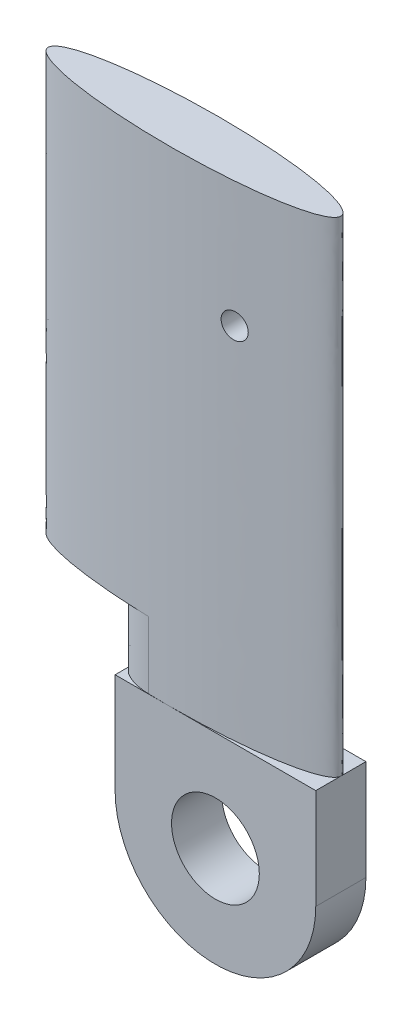
ISO-10303-21;
HEADER;
FILE_DESCRIPTION(('STEP AP214'),'2;1');
FILE_NAME('part.step','',(''),(''),'','','');
FILE_SCHEMA(('AUTOMOTIVE_DESIGN { 1 0 10303 214 1 1 1 1 }'));
ENDSEC;
DATA;
#1=APPLICATION_CONTEXT('core data for automotive mechanical design processes');
#2=APPLICATION_PROTOCOL_DEFINITION('international standard','automotive_design',2000,#1);
#3=PRODUCT_CONTEXT('',#1,'mechanical');
#4=PRODUCT('Part','Part','',(#3));
#5=PRODUCT_RELATED_PRODUCT_CATEGORY('part','',(#4));
#6=PRODUCT_DEFINITION_FORMATION('','',#4);
#7=PRODUCT_DEFINITION_CONTEXT('part definition',#1,'design');
#8=PRODUCT_DEFINITION('design','',#6,#7);
#9=PRODUCT_DEFINITION_SHAPE('','',#8);
#10=(LENGTH_UNIT() NAMED_UNIT(*) SI_UNIT(.MILLI.,.METRE.));
#11=(NAMED_UNIT(*) PLANE_ANGLE_UNIT() SI_UNIT($,.RADIAN.));
#12=(NAMED_UNIT(*) SI_UNIT($,.STERADIAN.) SOLID_ANGLE_UNIT());
#13=UNCERTAINTY_MEASURE_WITH_UNIT(LENGTH_MEASURE(1.E-05),#10,'distance_accuracy_value','');
#14=(GEOMETRIC_REPRESENTATION_CONTEXT(3) GLOBAL_UNCERTAINTY_ASSIGNED_CONTEXT((#13)) GLOBAL_UNIT_ASSIGNED_CONTEXT((#10,
#11,#12)) REPRESENTATION_CONTEXT('',''));
#15=CARTESIAN_POINT('',(0.,0.,0.));
#16=DIRECTION('',(0.,0.,1.));
#17=DIRECTION('',(1.,0.,0.));
#18=AXIS2_PLACEMENT_3D('',#15,#16,#17);
#19=CARTESIAN_POINT('',(6.,0.,3.));
#20=DIRECTION('',(-1.,0.,0.));
#21=DIRECTION('',(0.,0.,1.));
#22=AXIS2_PLACEMENT_3D('',#19,#20,#21);
#23=PLANE('',#22);
#24=DIRECTION('',(0.,0.,-1.));
#25=VECTOR('',#24,1.);
#26=CARTESIAN_POINT('',(6.,6.,0.));
#27=LINE('',#26,#25);
#28=CARTESIAN_POINT('',(6.,6.,3.));
#29=VERTEX_POINT('',#28);
#30=CARTESIAN_POINT('',(6.,6.,1.5));
#31=VERTEX_POINT('',#30);
#32=EDGE_CURVE('E182',#29,#31,#27,.T.);
#33=ORIENTED_EDGE('',*,*,#32,.F.);
#34=DIRECTION('',(0.,1.,0.));
#35=VECTOR('',#34,1.);
#36=CARTESIAN_POINT('',(6.,0.,3.));
#37=LINE('',#36,#35);
#38=CARTESIAN_POINT('',(6.,0.,3.));
#39=VERTEX_POINT('',#38);
#40=EDGE_CURVE('E193',#39,#29,#37,.T.);
#41=ORIENTED_EDGE('',*,*,#40,.F.);
#42=DIRECTION('',(0.,0.,-1.));
#43=VECTOR('',#42,1.);
#44=CARTESIAN_POINT('',(6.,0.,3.));
#45=LINE('',#44,#43);
#46=CARTESIAN_POINT('',(6.,0.,0.));
#47=VERTEX_POINT('',#46);
#48=EDGE_CURVE('E229',#39,#47,#45,.T.);
#49=ORIENTED_EDGE('',*,*,#48,.T.);
#50=DIRECTION('',(0.,1.,0.));
#51=VECTOR('',#50,1.);
#52=CARTESIAN_POINT('',(6.,0.,0.));
#53=LINE('',#52,#51);
#54=CARTESIAN_POINT('',(6.,6.,0.));
#55=VERTEX_POINT('',#54);
#56=EDGE_CURVE('E220',#47,#55,#53,.T.);
#57=ORIENTED_EDGE('',*,*,#56,.T.);
#58=DIRECTION('',(0.,0.,-1.));
#59=VECTOR('',#58,1.);
#60=CARTESIAN_POINT('',(6.,6.,0.));
#61=LINE('',#60,#59);
#62=EDGE_CURVE('E196',#31,#55,#61,.T.);
#63=ORIENTED_EDGE('',*,*,#62,.F.);
#64=EDGE_LOOP('',(#33,#41,#49,#57,#63));
#65=FACE_BOUND('',#64,.T.);
#66=ADVANCED_FACE('F103',(#65),#23,.F.);
#67=CARTESIAN_POINT('',(1.,27.5,10.));
#68=DIRECTION('',(0.,0.,-1.));
#69=DIRECTION('',(-1.,0.,0.));
#70=AXIS2_PLACEMENT_3D('',#67,#68,#69);
#71=CYLINDRICAL_SURFACE('',#70,0.750000000000001);
#72=CARTESIAN_POINT('',(0.249999999999999,27.5,0.090918666619406));
#73=CARTESIAN_POINT('',(0.250001871101678,27.4579380162254,0.0909187274566791));
#74=CARTESIAN_POINT('',(0.253550394195468,27.4158456191973,0.0911403459693025));
#75=CARTESIAN_POINT('',(0.267655649566795,27.3328210520766,0.0920264632065655));
#76=CARTESIAN_POINT('',(0.278220787188918,27.2918903349781,0.0926914931064635));
#77=CARTESIAN_POINT('',(0.306052527448953,27.2124102055516,0.0944606861977948));
#78=CARTESIAN_POINT('',(0.323314802548954,27.1738592740683,0.0955645658258764));
#79=CARTESIAN_POINT('',(0.364047103590972,27.1002059943157,0.0982038996413484));
#80=CARTESIAN_POINT('',(0.387517310275581,27.0651037464947,0.0997393663943868));
#81=CARTESIAN_POINT('',(0.440010837041838,26.9993163502715,0.103229269780537));
#82=CARTESIAN_POINT('',(0.469037869447986,26.968634178922,0.105183986605919));
#83=CARTESIAN_POINT('',(0.531806446777198,26.912577226396,0.109489324694288));
#84=CARTESIAN_POINT('',(0.565548211058525,26.8872026923008,0.111839964379084));
#85=CARTESIAN_POINT('',(0.636850956164615,26.8424300704041,0.116907841765143));
#86=CARTESIAN_POINT('',(0.674418925372981,26.8230431888366,0.119625753339545));
#87=CARTESIAN_POINT('',(0.752252798890975,26.7908490634601,0.125376727836869));
#88=CARTESIAN_POINT('',(0.792518734609657,26.7780418962656,0.128409794428972));
#89=CARTESIAN_POINT('',(0.874714109331914,26.759335106719,0.134735487485232));
#90=CARTESIAN_POINT('',(0.916647552188809,26.7534532955081,0.138028760081103));
#91=CARTESIAN_POINT('',(1.00089290856302,26.7488149446667,0.144787318572042));
#92=CARTESIAN_POINT('',(1.04320482731909,26.7500585038164,0.14825260685113));
#93=CARTESIAN_POINT('',(1.12711468234507,26.7596424406635,0.155266973474645));
#94=CARTESIAN_POINT('',(1.16871064544777,26.7679999663454,0.158816234116996));
#95=CARTESIAN_POINT('',(1.24990596029793,26.7915972644977,0.165878954280772));
#96=CARTESIAN_POINT('',(1.28950529041028,26.8068371115258,0.169392413413931));
#97=CARTESIAN_POINT('',(1.36561847469962,26.8437879021506,0.176264602475583));
#98=CARTESIAN_POINT('',(1.40212959493835,26.8655045041094,0.17962319413079));
#99=CARTESIAN_POINT('',(1.47098610201728,26.9147951311574,0.186054896146754));
#100=CARTESIAN_POINT('',(1.50333151503135,26.9423691194406,0.189128008301195));
#101=CARTESIAN_POINT('',(1.56287169870835,27.0025428684901,0.19485759839942));
#102=CARTESIAN_POINT('',(1.5900759174788,27.0351332065021,0.197514839025141));
#103=CARTESIAN_POINT('',(1.63862043287547,27.1044568454896,0.20230385474948));
#104=CARTESIAN_POINT('',(1.65996086672638,27.141190049485,0.204435642144669));
#105=CARTESIAN_POINT('',(1.69607611619668,27.2175894474931,0.208068220114216));
#106=CARTESIAN_POINT('',(1.71087864053771,27.2572424160263,0.209571672188662));
#107=CARTESIAN_POINT('',(1.73361692824854,27.3384896632034,0.211889591991494));
#108=CARTESIAN_POINT('',(1.74155288330293,27.3800838876218,0.212704078952757));
#109=CARTESIAN_POINT('',(1.75030509030968,27.463839786766,0.213602688706371));
#110=CARTESIAN_POINT('',(1.75115203706881,27.505998222575,0.213689960272589));
#111=CARTESIAN_POINT('',(1.74578205385793,27.5898575410621,0.213138190832505));
#112=CARTESIAN_POINT('',(1.73956521164403,27.6315584294179,0.212499158849343));
#113=CARTESIAN_POINT('',(1.72026378382679,27.7132593591584,0.210527023830983));
#114=CARTESIAN_POINT('',(1.70718887288623,27.753261710953,0.209194898562283));
#115=CARTESIAN_POINT('',(1.67455702034831,27.830500472244,0.205899902674134));
#116=CARTESIAN_POINT('',(1.65500000955688,27.8677368522095,0.203937025321642));
#117=CARTESIAN_POINT('',(1.60990906309202,27.9384920540501,0.199464056033178));
#118=CARTESIAN_POINT('',(1.58436006228743,27.9720011865022,0.196952585929488));
#119=CARTESIAN_POINT('',(1.52804247782856,28.0342595097139,0.191494617776675));
#120=CARTESIAN_POINT('',(1.49727376260949,28.0630085804583,0.188548108762482));
#121=CARTESIAN_POINT('',(1.43123368885517,28.1150720406906,0.182326260643494));
#122=CARTESIAN_POINT('',(1.39594211762353,28.1383606174606,0.179049460428931));
#123=CARTESIAN_POINT('',(1.3219673860026,28.1786837798956,0.172304419177172));
#124=CARTESIAN_POINT('',(1.28328415390351,28.1957182332904,0.168836174092838));
#125=CARTESIAN_POINT('',(1.2034662131261,28.223110193341,0.161817736246812));
#126=CARTESIAN_POINT('',(1.16232292324603,28.2334426353868,0.158267286711979));
#127=CARTESIAN_POINT('',(1.07888027667757,28.2470373598673,0.151211812560607));
#128=CARTESIAN_POINT('',(1.03658090817342,28.2502995700131,0.147706788408879));
#129=CARTESIAN_POINT('',(0.951981510804557,28.2496568238436,0.140840316260735));
#130=CARTESIAN_POINT('',(0.909681524277877,28.2457446376064,0.137479016594585));
#131=CARTESIAN_POINT('',(0.826328429346324,28.2308423918013,0.130989939565388));
#132=CARTESIAN_POINT('',(0.78527531621162,28.2198523590857,0.127862161316446));
#133=CARTESIAN_POINT('',(0.705648303476054,28.1911193779704,0.121913873047706));
#134=CARTESIAN_POINT('',(0.667070890373166,28.1733862586542,0.119092923438876));
#135=CARTESIAN_POINT('',(0.593437883896099,28.1316626780072,0.113806072363543));
#136=CARTESIAN_POINT('',(0.558382107488774,28.1076725421111,0.111340152441879));
#137=CARTESIAN_POINT('',(0.492884039297407,28.054181186559,0.106807164754878));
#138=CARTESIAN_POINT('',(0.462430194904209,28.0246941967085,0.104739094542413));
#139=CARTESIAN_POINT('',(0.406905788049258,27.9610029578913,0.101019578076293));
#140=CARTESIAN_POINT('',(0.381835012996354,27.9267988953013,0.0993681153692927));
#141=CARTESIAN_POINT('',(0.337839468369871,27.8547166638032,0.0965003298415715));
#142=CARTESIAN_POINT('',(0.318903666189789,27.8168452511069,0.0952832255033777));
#143=CARTESIAN_POINT('',(0.287678457348466,27.7384804451442,0.0932900073585266));
#144=CARTESIAN_POINT('',(0.275381022763311,27.697990285476,0.0925133608387512));
#145=CARTESIAN_POINT('',(0.261064839711674,27.631034076983,0.0916120868976018));
#146=CARTESIAN_POINT('',(0.256920772445154,27.6050050596343,0.0913521591243063));
#147=CARTESIAN_POINT('',(0.251387768094811,27.5526546681786,0.0910054300177351));
#148=CARTESIAN_POINT('',(0.249998828579471,27.5263332943296,0.090918628531668));
#149=CARTESIAN_POINT('',(0.249999999999999,27.5,0.090918666619406));
#150=B_SPLINE_CURVE_WITH_KNOTS('',3,(#72,#73,#74,#75,#76,#77,#78,#79,#80,#81,#82,#83,#84,#85,
#86,#87,#88,#89,#90,#91,#92,#93,#94,#95,#96,#97,#98,#99,#100,#101,#102,#103,#104,#105,#106,#107,
#108,#109,#110,#111,#112,#113,#114,#115,#116,#117,#118,#119,#120,#121,#122,#123,#124,#125,#126,
#127,#128,#129,#130,#131,#132,#133,#134,#135,#136,#137,#138,#139,#140,#141,#142,#143,#144,#145,
#146,#147,#148,#149),.UNSPECIFIED.,.T.,.F.,(4,2,2,2,2,2,2,2,2,2,2,2,2,2,2,2,2,2,2,2,2,2,2,2,2,2,
2,2,2,2,2,2,2,2,2,2,2,2,4),(0.,0.126089770920813,0.252330860436872,0.378490511335345,
0.504653835749297,0.630901741555701,0.757155523146562,0.883644183730423,1.01013431711964,
1.13694906145163,1.26376556384131,1.3908886217585,1.51801305685979,1.64524888011524,
1.77248390388718,1.89948278105559,2.02647868593458,2.15293107225193,2.27937992845791,
2.40528098704222,2.53118048152759,2.65690284565192,2.78262655185994,2.90866980838942,
3.03471624235676,3.16134701977468,3.28798047518907,3.41508483282092,3.54219049001425,
3.66942430698177,3.79665764124629,3.92370621996357,4.05074819205239,4.17746574377115,
4.30417829016944,4.43066168626294,4.55699177857488,4.63593151659961,4.71487118495664),.UNSPECIFIED.);
#151=CARTESIAN_POINT('',(0.249999999999999,27.5,0.090918666619406));
#152=VERTEX_POINT('',#151);
#153=EDGE_CURVE('E305',#152,#152,#150,.T.);
#154=ORIENTED_EDGE('',*,*,#153,.F.);
#155=EDGE_LOOP('',(#154));
#156=FACE_BOUND('',#155,.T.);
#157=CARTESIAN_POINT('',(0.249999999999999,27.5,2.90908133338059));
#158=CARTESIAN_POINT('',(0.250001871101678,27.5420619837746,2.90908127254332));
#159=CARTESIAN_POINT('',(0.253550394195469,27.5841543808027,2.9088596540307));
#160=CARTESIAN_POINT('',(0.267655649566795,27.6671789479234,2.90797353679344));
#161=CARTESIAN_POINT('',(0.278220787188917,27.7081096650219,2.90730850689354));
#162=CARTESIAN_POINT('',(0.306052527448952,27.7875897944485,2.90553931380221));
#163=CARTESIAN_POINT('',(0.323314802548955,27.8261407259317,2.90443543417412));
#164=CARTESIAN_POINT('',(0.364047103590974,27.8997940056844,2.90179610035865));
#165=CARTESIAN_POINT('',(0.387517310275584,27.9348962535053,2.90026063360561));
#166=CARTESIAN_POINT('',(0.440010837041842,28.0006836497285,2.89677073021946));
#167=CARTESIAN_POINT('',(0.46903786944799,28.031365821078,2.89481601339408));
#168=CARTESIAN_POINT('',(0.531806446777203,28.087422773604,2.89051067530571));
#169=CARTESIAN_POINT('',(0.56554821105853,28.1127973076993,2.88816003562092));
#170=CARTESIAN_POINT('',(0.636850956164619,28.1575699295959,2.88309215823486));
#171=CARTESIAN_POINT('',(0.674418925372985,28.1769568111634,2.88037424666046));
#172=CARTESIAN_POINT('',(0.752252798890979,28.2091509365399,2.87462327216313));
#173=CARTESIAN_POINT('',(0.79251873460966,28.2219581037345,2.87159020557103));
#174=CARTESIAN_POINT('',(0.874714109331918,28.240664893281,2.86526451251477));
#175=CARTESIAN_POINT('',(0.916647552188814,28.2465467044919,2.8619712399189));
#176=CARTESIAN_POINT('',(1.00089290856303,28.2511850553333,2.85521268142796));
#177=CARTESIAN_POINT('',(1.0432048273191,28.2499414961836,2.85174739314887));
#178=CARTESIAN_POINT('',(1.12711468234508,28.2403575593365,2.84473302652535));
#179=CARTESIAN_POINT('',(1.16871064544777,28.2320000336546,2.841183765883));
#180=CARTESIAN_POINT('',(1.24990596029794,28.2084027355023,2.83412104571923));
#181=CARTESIAN_POINT('',(1.28950529041029,28.1931628884742,2.83060758658607));
#182=CARTESIAN_POINT('',(1.36561847469962,28.1562120978494,2.82373539752442));
#183=CARTESIAN_POINT('',(1.40212959493835,28.1344954958906,2.82037680586921));
#184=CARTESIAN_POINT('',(1.47098610201729,28.0852048688426,2.81394510385325));
#185=CARTESIAN_POINT('',(1.50333151503135,28.0576308805594,2.81087199169881));
#186=CARTESIAN_POINT('',(1.56287169870836,27.9974571315099,2.80514240160058));
#187=CARTESIAN_POINT('',(1.59007591747881,27.9648667934979,2.80248516097486));
#188=CARTESIAN_POINT('',(1.63862043287548,27.8955431545104,2.79769614525052));
#189=CARTESIAN_POINT('',(1.65996086672639,27.858809950515,2.79556435785533));
#190=CARTESIAN_POINT('',(1.69607611619669,27.7824105525069,2.79193177988578));
#191=CARTESIAN_POINT('',(1.71087864053771,27.7427575839737,2.79042832781134));
#192=CARTESIAN_POINT('',(1.73361692824854,27.6615103367966,2.78811040800851));
#193=CARTESIAN_POINT('',(1.74155288330292,27.6199161123782,2.78729592104724));
#194=CARTESIAN_POINT('',(1.75030509030968,27.536160213234,2.78639731129363));
#195=CARTESIAN_POINT('',(1.75115203706881,27.494001777425,2.78631003972741));
#196=CARTESIAN_POINT('',(1.74578205385793,27.4101424589379,2.7868618091675));
#197=CARTESIAN_POINT('',(1.73956521164403,27.3684415705821,2.78750084115066));
#198=CARTESIAN_POINT('',(1.72026378382679,27.2867406408416,2.78947297616902));
#199=CARTESIAN_POINT('',(1.70718887288623,27.246738289047,2.79080510143772));
#200=CARTESIAN_POINT('',(1.6745570203483,27.169499527756,2.79410009732587));
#201=CARTESIAN_POINT('',(1.65500000955688,27.1322631477905,2.79606297467836));
#202=CARTESIAN_POINT('',(1.60990906309202,27.0615079459499,2.80053594396682));
#203=CARTESIAN_POINT('',(1.58436006228743,27.0279988134978,2.80304741407051));
#204=CARTESIAN_POINT('',(1.52804247782855,26.9657404902861,2.80850538222333));
#205=CARTESIAN_POINT('',(1.49727376260949,26.9369914195417,2.81145189123752));
#206=CARTESIAN_POINT('',(1.43123368885516,26.8849279593094,2.81767373935651));
#207=CARTESIAN_POINT('',(1.39594211762353,26.8616393825394,2.82095053957107));
#208=CARTESIAN_POINT('',(1.32196738600259,26.8213162201044,2.82769558082283));
#209=CARTESIAN_POINT('',(1.28328415390351,26.8042817667096,2.83116382590716));
#210=CARTESIAN_POINT('',(1.20346621312609,26.776889806659,2.83818226375319));
#211=CARTESIAN_POINT('',(1.16232292324603,26.7665573646132,2.84173271328802));
#212=CARTESIAN_POINT('',(1.07888027667756,26.7529626401327,2.84878818743939));
#213=CARTESIAN_POINT('',(1.03658090817342,26.7497004299869,2.85229321159112));
#214=CARTESIAN_POINT('',(0.951981510804553,26.7503431761564,2.85915968373927));
#215=CARTESIAN_POINT('',(0.909681524277872,26.7542553623936,2.86252098340542));
#216=CARTESIAN_POINT('',(0.826328429346318,26.7691576081987,2.86901006043461));
#217=CARTESIAN_POINT('',(0.785275316211614,26.7801476409143,2.87213783868356));
#218=CARTESIAN_POINT('',(0.705648303476047,26.8088806220296,2.8780861269523));
#219=CARTESIAN_POINT('',(0.667070890373159,26.8266137413459,2.88090707656113));
#220=CARTESIAN_POINT('',(0.593437883896093,26.8683373219929,2.88619392763646));
#221=CARTESIAN_POINT('',(0.558382107488768,26.8923274578889,2.88865984755812));
#222=CARTESIAN_POINT('',(0.492884039297402,26.945818813441,2.89319283524512));
#223=CARTESIAN_POINT('',(0.462430194904203,26.9753058032915,2.89526090545759));
#224=CARTESIAN_POINT('',(0.406905788049254,27.0389970421088,2.89898042192371));
#225=CARTESIAN_POINT('',(0.381835012996351,27.0732011046987,2.90063188463071));
#226=CARTESIAN_POINT('',(0.337839468369868,27.1452833361968,2.90349967015843));
#227=CARTESIAN_POINT('',(0.318903666189785,27.1831547488931,2.90471677449662));
#228=CARTESIAN_POINT('',(0.287678457348464,27.2615195548558,2.90670999264147));
#229=CARTESIAN_POINT('',(0.275381022763312,27.302009714524,2.90748663916125));
#230=CARTESIAN_POINT('',(0.261064839711675,27.3689659230171,2.9083879131024));
#231=CARTESIAN_POINT('',(0.256920772445154,27.3949949403657,2.90864784087569));
#232=CARTESIAN_POINT('',(0.251387768094811,27.4473453318215,2.90899456998227));
#233=CARTESIAN_POINT('',(0.249998828579471,27.4736667056704,2.90908137146833));
#234=CARTESIAN_POINT('',(0.249999999999999,27.5,2.90908133338059));
#235=B_SPLINE_CURVE_WITH_KNOTS('',3,(#157,#158,#159,#160,#161,#162,#163,#164,#165,#166,#167,
#168,#169,#170,#171,#172,#173,#174,#175,#176,#177,#178,#179,#180,#181,#182,#183,#184,#185,#186,
#187,#188,#189,#190,#191,#192,#193,#194,#195,#196,#197,#198,#199,#200,#201,#202,#203,#204,#205,
#206,#207,#208,#209,#210,#211,#212,#213,#214,#215,#216,#217,#218,#219,#220,#221,#222,#223,#224,
#225,#226,#227,#228,#229,#230,#231,#232,#233,#234),.UNSPECIFIED.,.T.,.F.,(4,2,2,2,2,2,2,2,2,2,2,
2,2,2,2,2,2,2,2,2,2,2,2,2,2,2,2,2,2,2,2,2,2,2,2,2,2,2,4),(0.,0.126089770920817,
0.252330860436875,0.378490511335349,0.504653835749302,0.630901741555704,0.757155523146565,
0.883644183730426,1.01013431711964,1.13694906145164,1.26376556384131,1.3908886217585,
1.51801305685979,1.64524888011525,1.77248390388719,1.89948278105559,2.02647868593459,
2.15293107225194,2.27937992845792,2.40528098704222,2.53118048152759,2.65690284565193,
2.78262655185994,2.90866980838942,3.03471624235676,3.16134701977468,3.28798047518908,
3.41508483282092,3.54219049001425,3.66942430698178,3.79665764124629,3.92370621996358,
4.05074819205239,4.17746574377116,4.30417829016944,4.43066168626295,4.55699177857488,
4.63593151659961,4.71487118495664),.UNSPECIFIED.);
#236=CARTESIAN_POINT('',(0.249999999999999,27.5,2.90908133338059));
#237=VERTEX_POINT('',#236);
#238=EDGE_CURVE('E197',#237,#237,#235,.T.);
#239=ORIENTED_EDGE('',*,*,#238,.F.);
#240=EDGE_LOOP('',(#239));
#241=FACE_BOUND('',#240,.T.);
#242=ADVANCED_FACE('F383',(#156,#241),#71,.F.);
#243=CARTESIAN_POINT('',(0.,0.,0.));
#244=DIRECTION('',(0.,0.,1.));
#245=DIRECTION('',(1.,0.,0.));
#246=AXIS2_PLACEMENT_3D('',#243,#244,#245);
#247=PLANE('',#246);
#248=CARTESIAN_POINT('',(0.,0.,0.));
#249=DIRECTION('',(0.,0.,1.));
#250=DIRECTION('',(1.,0.,0.));
#251=AXIS2_PLACEMENT_3D('',#248,#249,#250);
#252=CIRCLE('',#251,2.625);
#253=CARTESIAN_POINT('',(2.625,0.,0.));
#254=VERTEX_POINT('',#253);
#255=EDGE_CURVE('E214',#254,#254,#252,.T.);
#256=ORIENTED_EDGE('',*,*,#255,.T.);
#257=EDGE_LOOP('',(#256));
#258=FACE_BOUND('',#257,.T.);
#259=DIRECTION('',(-1.,0.,0.));
#260=VECTOR('',#259,1.);
#261=CARTESIAN_POINT('',(0.,6.,0.));
#262=LINE('',#261,#260);
#263=CARTESIAN_POINT('',(-2.75,6.,0.));
#264=VERTEX_POINT('',#263);
#265=CARTESIAN_POINT('',(-6.,6.,0.));
#266=VERTEX_POINT('',#265);
#267=EDGE_CURVE('E277',#264,#266,#262,.T.);
#268=ORIENTED_EDGE('',*,*,#267,.F.);
#269=DIRECTION('',(-1.,0.,0.));
#270=VECTOR('',#269,1.);
#271=CARTESIAN_POINT('',(0.,6.,0.));
#272=LINE('',#271,#270);
#273=EDGE_CURVE('E493',#55,#264,#272,.T.);
#274=ORIENTED_EDGE('',*,*,#273,.F.);
#275=ORIENTED_EDGE('',*,*,#56,.F.);
#276=CARTESIAN_POINT('',(0.,0.,0.));
#277=DIRECTION('',(0.,0.,1.));
#278=DIRECTION('',(1.,0.,0.));
#279=AXIS2_PLACEMENT_3D('',#276,#277,#278);
#280=CIRCLE('',#279,6.);
#281=CARTESIAN_POINT('',(-6.,0.,0.));
#282=VERTEX_POINT('',#281);
#283=EDGE_CURVE('E217',#282,#47,#280,.T.);
#284=ORIENTED_EDGE('',*,*,#283,.F.);
#285=DIRECTION('',(0.,1.,0.));
#286=VECTOR('',#285,1.);
#287=CARTESIAN_POINT('',(-6.,0.,0.));
#288=LINE('',#287,#286);
#289=EDGE_CURVE('E222',#282,#266,#288,.T.);
#290=ORIENTED_EDGE('',*,*,#289,.T.);
#291=EDGE_LOOP('',(#268,#274,#275,#284,#290));
#292=FACE_BOUND('',#291,.T.);
#293=ADVANCED_FACE('F260',(#258,#292),#247,.F.);
#294=CARTESIAN_POINT('',(0.,10.,3.));
#295=DIRECTION('',(0.,1.,0.));
#296=DIRECTION('',(0.,0.,1.));
#297=AXIS2_PLACEMENT_3D('',#294,#295,#296);
#298=PLANE('',#297);
#299=CARTESIAN_POINT('',(-2.75,10.,1.5));
#300=DIRECTION('',(0.,1.,0.));
#301=DIRECTION('',(1.,0.,0.));
#302=AXIS2_PLACEMENT_3D('',#299,#300,#301);
#303=ELLIPSE('',#302,8.75,1.5);
#304=CARTESIAN_POINT('',(-4.02524601077442,10.,0.0160161412308211));
#305=VERTEX_POINT('',#304);
#306=CARTESIAN_POINT('',(-4.02524601077442,10.,2.98398385876918));
#307=VERTEX_POINT('',#306);
#308=EDGE_CURVE('E123',#305,#307,#303,.T.);
#309=ORIENTED_EDGE('',*,*,#308,.F.);
#310=CARTESIAN_POINT('',(-6.,10.,1.01569740990598));
#311=CARTESIAN_POINT('',(-6.,10.,0.0658866970279689));
#312=CARTESIAN_POINT('',(-4.02524601077443,10.,0.0160161412308211));
#313=(BOUNDED_CURVE() B_SPLINE_CURVE(2,(#310,#311,#312),.UNSPECIFIED.,.F.,
.F.) B_SPLINE_CURVE_WITH_KNOTS((3,3),(0.,1.),
.UNSPECIFIED.) CURVE() GEOMETRIC_REPRESENTATION_ITEM() RATIONAL_B_SPLINE_CURVE((1.,
0.715976958698541,1.)) REPRESENTATION_ITEM(''));
#314=CARTESIAN_POINT('',(-6.,10.,1.01569740990598));
#315=VERTEX_POINT('',#314);
#316=EDGE_CURVE('E14',#305,#315,#313,.F.);
#317=ORIENTED_EDGE('',*,*,#316,.T.);
#318=DIRECTION('',(0.,0.,-1.));
#319=VECTOR('',#318,1.);
#320=CARTESIAN_POINT('',(-6.,10.,3.));
#321=LINE('',#320,#319);
#322=CARTESIAN_POINT('',(-6.,10.,1.98430259009402));
#323=VERTEX_POINT('',#322);
#324=EDGE_CURVE('E226',#323,#315,#321,.T.);
#325=ORIENTED_EDGE('',*,*,#324,.F.);
#326=CARTESIAN_POINT('',(-4.02524601077443,10.,2.98398385876918));
#327=CARTESIAN_POINT('',(-6.,10.,2.93411330297203));
#328=CARTESIAN_POINT('',(-6.,10.,1.98430259009402));
#329=(BOUNDED_CURVE() B_SPLINE_CURVE(2,(#326,#327,#328),.UNSPECIFIED.,.F.,
.F.) B_SPLINE_CURVE_WITH_KNOTS((3,3),(0.,1.),
.UNSPECIFIED.) CURVE() GEOMETRIC_REPRESENTATION_ITEM() RATIONAL_B_SPLINE_CURVE((1.,
0.715976958698541,1.)) REPRESENTATION_ITEM(''));
#330=EDGE_CURVE('E337',#323,#307,#329,.F.);
#331=ORIENTED_EDGE('',*,*,#330,.T.);
#332=EDGE_LOOP('',(#309,#317,#325,#331));
#333=FACE_BOUND('',#332,.T.);
#334=ADVANCED_FACE('F259',(#333),#298,.F.);
#335=CARTESIAN_POINT('',(-6.,0.,3.));
#336=DIRECTION('',(-1.,0.,0.));
#337=DIRECTION('',(0.,0.,1.));
#338=AXIS2_PLACEMENT_3D('',#335,#336,#337);
#339=PLANE('',#338);
#340=DIRECTION('',(0.,0.,-1.));
#341=VECTOR('',#340,1.);
#342=CARTESIAN_POINT('',(-6.,6.,3.));
#343=LINE('',#342,#341);
#344=CARTESIAN_POINT('',(-6.,6.,3.));
#345=VERTEX_POINT('',#344);
#346=CARTESIAN_POINT('',(-6.,6.,1.98430259009402));
#347=VERTEX_POINT('',#346);
#348=EDGE_CURVE('E480',#345,#347,#343,.T.);
#349=ORIENTED_EDGE('',*,*,#348,.T.);
#350=CARTESIAN_POINT('',(-6.,10.2,1.98430259009402));
#351=CARTESIAN_POINT('',(-6.,8.73333333333333,1.98430259009402));
#352=CARTESIAN_POINT('',(-6.,7.26666666666666,1.98430259009402));
#353=CARTESIAN_POINT('',(-6.,5.8,1.98430259009402));
#354=(BOUNDED_CURVE() B_SPLINE_CURVE(3,(#350,#351,#352,#353),.UNSPECIFIED.,.F.,
.F.) B_SPLINE_CURVE_WITH_KNOTS((4,4),(-0.0022,0.0022),
.UNSPECIFIED.) CURVE() GEOMETRIC_REPRESENTATION_ITEM() RATIONAL_B_SPLINE_CURVE((1.,1.,1.,1.)) REPRESENTATION_ITEM(''));
#355=EDGE_CURVE('E503',#347,#323,#354,.F.);
#356=ORIENTED_EDGE('',*,*,#355,.T.);
#357=ORIENTED_EDGE('',*,*,#324,.T.);
#358=CARTESIAN_POINT('',(-6.,5.8,1.01569740990598));
#359=CARTESIAN_POINT('',(-6.,7.26666666666666,1.01569740990598));
#360=CARTESIAN_POINT('',(-6.,8.73333333333333,1.01569740990598));
#361=CARTESIAN_POINT('',(-6.,10.2,1.01569740990598));
#362=(BOUNDED_CURVE() B_SPLINE_CURVE(3,(#358,#359,#360,#361),.UNSPECIFIED.,.F.,
.F.) B_SPLINE_CURVE_WITH_KNOTS((4,4),(-0.0022,0.0022),
.UNSPECIFIED.) CURVE() GEOMETRIC_REPRESENTATION_ITEM() RATIONAL_B_SPLINE_CURVE((1.,1.,1.,1.)) REPRESENTATION_ITEM(''));
#363=CARTESIAN_POINT('',(-6.,6.,1.01569740990598));
#364=VERTEX_POINT('',#363);
#365=EDGE_CURVE('E241',#315,#364,#362,.F.);
#366=ORIENTED_EDGE('',*,*,#365,.T.);
#367=DIRECTION('',(0.,0.,-1.));
#368=VECTOR('',#367,1.);
#369=CARTESIAN_POINT('',(-6.,6.,3.));
#370=LINE('',#369,#368);
#371=EDGE_CURVE('E485',#364,#266,#370,.T.);
#372=ORIENTED_EDGE('',*,*,#371,.T.);
#373=ORIENTED_EDGE('',*,*,#289,.F.);
#374=DIRECTION('',(0.,0.,-1.));
#375=VECTOR('',#374,1.);
#376=CARTESIAN_POINT('',(-6.,0.,3.));
#377=LINE('',#376,#375);
#378=CARTESIAN_POINT('',(-6.,0.,3.));
#379=VERTEX_POINT('',#378);
#380=EDGE_CURVE('E208',#379,#282,#377,.T.);
#381=ORIENTED_EDGE('',*,*,#380,.F.);
#382=DIRECTION('',(0.,1.,0.));
#383=VECTOR('',#382,1.);
#384=CARTESIAN_POINT('',(-6.,0.,3.));
#385=LINE('',#384,#383);
#386=EDGE_CURVE('E205',#379,#345,#385,.T.);
#387=ORIENTED_EDGE('',*,*,#386,.T.);
#388=EDGE_LOOP('',(#349,#356,#357,#366,#372,#373,#381,#387));
#389=FACE_BOUND('',#388,.T.);
#390=ADVANCED_FACE('F248',(#389),#339,.T.);
#391=CARTESIAN_POINT('',(0.,0.,3.));
#392=DIRECTION('',(0.,0.,-1.));
#393=DIRECTION('',(-1.,0.,0.));
#394=AXIS2_PLACEMENT_3D('',#391,#392,#393);
#395=CYLINDRICAL_SURFACE('',#394,6.);
#396=ORIENTED_EDGE('',*,*,#283,.T.);
#397=ORIENTED_EDGE('',*,*,#48,.F.);
#398=CARTESIAN_POINT('',(0.,0.,3.));
#399=DIRECTION('',(0.,0.,1.));
#400=DIRECTION('',(1.,0.,0.));
#401=AXIS2_PLACEMENT_3D('',#398,#399,#400);
#402=CIRCLE('',#401,6.);
#403=EDGE_CURVE('E203',#379,#39,#402,.T.);
#404=ORIENTED_EDGE('',*,*,#403,.F.);
#405=ORIENTED_EDGE('',*,*,#380,.T.);
#406=EDGE_LOOP('',(#396,#397,#404,#405));
#407=FACE_BOUND('',#406,.T.);
#408=ADVANCED_FACE('F258',(#407),#395,.T.);
#409=CARTESIAN_POINT('',(0.,35.,3.));
#410=DIRECTION('',(0.,-1.,0.));
#411=DIRECTION('',(0.,0.,-1.));
#412=AXIS2_PLACEMENT_3D('',#409,#410,#411);
#413=PLANE('',#412);
#414=CARTESIAN_POINT('',(-2.75,35.,1.5));
#415=DIRECTION('',(0.,1.,0.));
#416=DIRECTION('',(1.,0.,0.));
#417=AXIS2_PLACEMENT_3D('',#414,#415,#416);
#418=ELLIPSE('',#417,8.75,1.5);
#419=CARTESIAN_POINT('',(6.,35.,1.5));
#420=VERTEX_POINT('',#419);
#421=EDGE_CURVE('E285',#420,#420,#418,.T.);
#422=ORIENTED_EDGE('',*,*,#421,.T.);
#423=EDGE_LOOP('',(#422));
#424=FACE_BOUND('',#423,.T.);
#425=ADVANCED_FACE('F391',(#424),#413,.F.);
#426=CARTESIAN_POINT('',(0.,0.,3.));
#427=DIRECTION('',(0.,0.,-1.));
#428=DIRECTION('',(-1.,0.,0.));
#429=AXIS2_PLACEMENT_3D('',#426,#427,#428);
#430=CYLINDRICAL_SURFACE('',#429,2.625);
#431=CARTESIAN_POINT('',(0.,0.,3.));
#432=DIRECTION('',(0.,0.,1.));
#433=DIRECTION('',(1.,0.,0.));
#434=AXIS2_PLACEMENT_3D('',#431,#432,#433);
#435=CIRCLE('',#434,2.625);
#436=CARTESIAN_POINT('',(2.625,0.,3.));
#437=VERTEX_POINT('',#436);
#438=EDGE_CURVE('E210',#437,#437,#435,.T.);
#439=ORIENTED_EDGE('',*,*,#438,.T.);
#440=EDGE_LOOP('',(#439));
#441=FACE_BOUND('',#440,.T.);
#442=ORIENTED_EDGE('',*,*,#255,.F.);
#443=EDGE_LOOP('',(#442));
#444=FACE_BOUND('',#443,.T.);
#445=ADVANCED_FACE('F395',(#441,#444),#430,.F.);
#446=CARTESIAN_POINT('',(0.,0.,3.));
#447=DIRECTION('',(0.,0.,1.));
#448=DIRECTION('',(1.,0.,0.));
#449=AXIS2_PLACEMENT_3D('',#446,#447,#448);
#450=PLANE('',#449);
#451=DIRECTION('',(1.,0.,0.));
#452=VECTOR('',#451,1.);
#453=CARTESIAN_POINT('',(0.,6.,3.));
#454=LINE('',#453,#452);
#455=CARTESIAN_POINT('',(-2.75,6.,3.));
#456=VERTEX_POINT('',#455);
#457=EDGE_CURVE('E179',#456,#29,#454,.T.);
#458=ORIENTED_EDGE('',*,*,#457,.F.);
#459=DIRECTION('',(1.,0.,0.));
#460=VECTOR('',#459,1.);
#461=CARTESIAN_POINT('',(0.,6.,3.));
#462=LINE('',#461,#460);
#463=EDGE_CURVE('E235',#345,#456,#462,.T.);
#464=ORIENTED_EDGE('',*,*,#463,.F.);
#465=ORIENTED_EDGE('',*,*,#386,.F.);
#466=ORIENTED_EDGE('',*,*,#403,.T.);
#467=ORIENTED_EDGE('',*,*,#40,.T.);
#468=EDGE_LOOP('',(#458,#464,#465,#466,#467));
#469=FACE_BOUND('',#468,.T.);
#470=ORIENTED_EDGE('',*,*,#438,.F.);
#471=EDGE_LOOP('',(#470));
#472=FACE_BOUND('',#471,.T.);
#473=ADVANCED_FACE('F199',(#469,#472),#450,.T.);
#474=CARTESIAN_POINT('',(-2.75,6.,1.5));
#475=DIRECTION('',(0.,1.,0.));
#476=DIRECTION('',(1.,0.,0.));
#477=AXIS2_PLACEMENT_3D('',#474,#475,#476);
#478=ELLIPSE('',#477,8.75,1.5);
#479=DIRECTION('',(0.,1.,0.));
#480=VECTOR('',#479,1.);
#481=SURFACE_OF_LINEAR_EXTRUSION('',#478,#480);
#482=ORIENTED_EDGE('',*,*,#421,.F.);
#483=EDGE_LOOP('',(#482));
#484=FACE_BOUND('',#483,.T.);
#485=ORIENTED_EDGE('',*,*,#308,.T.);
#486=CARTESIAN_POINT('',(-4.02524601077442,10.,2.98398385876918));
#487=DIRECTION('',(0.,-1.,0.));
#488=VECTOR('',#487,1.);
#489=LINE('',#486,#488);
#490=CARTESIAN_POINT('',(-4.02524601077443,6.,2.98398385876918));
#491=VERTEX_POINT('',#490);
#492=EDGE_CURVE('E325',#307,#491,#489,.T.);
#493=ORIENTED_EDGE('',*,*,#492,.T.);
#494=EDGE_CURVE('E278',#491,#456,#478,.T.);
#495=ORIENTED_EDGE('',*,*,#494,.T.);
#496=EDGE_CURVE('E184',#456,#31,#478,.T.);
#497=ORIENTED_EDGE('',*,*,#496,.T.);
#498=EDGE_CURVE('E280',#31,#264,#478,.T.);
#499=ORIENTED_EDGE('',*,*,#498,.T.);
#500=CARTESIAN_POINT('',(-4.02524601077442,6.,0.0160161412308211));
#501=VERTEX_POINT('',#500);
#502=EDGE_CURVE('E268',#264,#501,#478,.T.);
#503=ORIENTED_EDGE('',*,*,#502,.T.);
#504=CARTESIAN_POINT('',(-4.02524601077442,6.,0.0160161412308211));
#505=DIRECTION('',(0.,1.,0.));
#506=VECTOR('',#505,1.);
#507=LINE('',#504,#506);
#508=EDGE_CURVE('E470',#501,#305,#507,.T.);
#509=ORIENTED_EDGE('',*,*,#508,.T.);
#510=EDGE_LOOP('',(#485,#493,#495,#497,#499,#503,#509));
#511=FACE_BOUND('',#510,.T.);
#512=ORIENTED_EDGE('',*,*,#153,.T.);
#513=EDGE_LOOP('',(#512));
#514=FACE_BOUND('',#513,.T.);
#515=ORIENTED_EDGE('',*,*,#238,.T.);
#516=EDGE_LOOP('',(#515));
#517=FACE_BOUND('',#516,.T.);
#518=ADVANCED_FACE('F292',(#484,#511,#514,#517),#481,.T.);
#519=CARTESIAN_POINT('',(0.,6.,0.));
#520=DIRECTION('',(0.,1.,0.));
#521=DIRECTION('',(0.,0.,1.));
#522=AXIS2_PLACEMENT_3D('',#519,#520,#521);
#523=PLANE('',#522);
#524=ORIENTED_EDGE('',*,*,#498,.F.);
#525=ORIENTED_EDGE('',*,*,#62,.T.);
#526=ORIENTED_EDGE('',*,*,#273,.T.);
#527=EDGE_LOOP('',(#524,#525,#526));
#528=FACE_BOUND('',#527,.T.);
#529=ADVANCED_FACE('F297',(#528),#523,.T.);
#530=CARTESIAN_POINT('',(0.,6.,0.));
#531=DIRECTION('',(0.,1.,0.));
#532=DIRECTION('',(0.,0.,1.));
#533=AXIS2_PLACEMENT_3D('',#530,#531,#532);
#534=PLANE('',#533);
#535=ORIENTED_EDGE('',*,*,#463,.T.);
#536=ORIENTED_EDGE('',*,*,#494,.F.);
#537=CARTESIAN_POINT('',(-6.,6.,1.98430259009402));
#538=CARTESIAN_POINT('',(-6.,6.,2.93411330297203));
#539=CARTESIAN_POINT('',(-4.02524601077443,6.,2.98398385876918));
#540=(BOUNDED_CURVE() B_SPLINE_CURVE(2,(#537,#538,#539),.UNSPECIFIED.,.F.,
.F.) B_SPLINE_CURVE_WITH_KNOTS((3,3),(0.,1.),
.UNSPECIFIED.) CURVE() GEOMETRIC_REPRESENTATION_ITEM() RATIONAL_B_SPLINE_CURVE((1.,
0.715976958698541,1.)) REPRESENTATION_ITEM(''));
#541=EDGE_CURVE('E350',#491,#347,#540,.F.);
#542=ORIENTED_EDGE('',*,*,#541,.T.);
#543=ORIENTED_EDGE('',*,*,#348,.F.);
#544=EDGE_LOOP('',(#535,#536,#542,#543));
#545=FACE_BOUND('',#544,.T.);
#546=ADVANCED_FACE('F300',(#545),#534,.T.);
#547=CARTESIAN_POINT('',(0.,6.,0.));
#548=DIRECTION('',(0.,1.,0.));
#549=DIRECTION('',(0.,0.,1.));
#550=AXIS2_PLACEMENT_3D('',#547,#548,#549);
#551=PLANE('',#550);
#552=ORIENTED_EDGE('',*,*,#502,.F.);
#553=ORIENTED_EDGE('',*,*,#267,.T.);
#554=ORIENTED_EDGE('',*,*,#371,.F.);
#555=CARTESIAN_POINT('',(-4.02524601077443,6.,0.0160161412308211));
#556=CARTESIAN_POINT('',(-6.,6.,0.0658866970279689));
#557=CARTESIAN_POINT('',(-6.,6.,1.01569740990598));
#558=(BOUNDED_CURVE() B_SPLINE_CURVE(2,(#555,#556,#557),.UNSPECIFIED.,.F.,
.F.) B_SPLINE_CURVE_WITH_KNOTS((3,3),(0.,1.),
.UNSPECIFIED.) CURVE() GEOMETRIC_REPRESENTATION_ITEM() RATIONAL_B_SPLINE_CURVE((1.,
0.715976958698541,1.)) REPRESENTATION_ITEM(''));
#559=EDGE_CURVE('E116',#364,#501,#558,.F.);
#560=ORIENTED_EDGE('',*,*,#559,.T.);
#561=EDGE_LOOP('',(#552,#553,#554,#560));
#562=FACE_BOUND('',#561,.T.);
#563=ADVANCED_FACE('F367',(#562),#551,.T.);
#564=CARTESIAN_POINT('',(0.,6.,0.));
#565=DIRECTION('',(0.,1.,0.));
#566=DIRECTION('',(0.,0.,1.));
#567=AXIS2_PLACEMENT_3D('',#564,#565,#566);
#568=PLANE('',#567);
#569=ORIENTED_EDGE('',*,*,#496,.F.);
#570=ORIENTED_EDGE('',*,*,#457,.T.);
#571=ORIENTED_EDGE('',*,*,#32,.T.);
#572=EDGE_LOOP('',(#569,#570,#571));
#573=FACE_BOUND('',#572,.T.);
#574=ADVANCED_FACE('F181',(#573),#568,.T.);
#575=CARTESIAN_POINT('',(-6.,5.8,1.98430259009402));
#576=CARTESIAN_POINT('',(-6.,7.26666666666666,1.98430259009402));
#577=CARTESIAN_POINT('',(-6.,8.73333333333333,1.98430259009402));
#578=CARTESIAN_POINT('',(-6.,10.2,1.98430259009402));
#579=CARTESIAN_POINT('',(-6.,5.8,2.93411330297203));
#580=CARTESIAN_POINT('',(-6.,7.26666666666666,2.93411330297203));
#581=CARTESIAN_POINT('',(-6.,8.73333333333334,2.93411330297203));
#582=CARTESIAN_POINT('',(-6.,10.2,2.93411330297203));
#583=CARTESIAN_POINT('',(-4.02524601077443,5.8,2.98398385876918));
#584=CARTESIAN_POINT('',(-4.02524601077443,7.26666666666666,2.98398385876918));
#585=CARTESIAN_POINT('',(-4.02524601077443,8.73333333333333,2.98398385876918));
#586=CARTESIAN_POINT('',(-4.02524601077443,10.2,2.98398385876918));
#587=(BOUNDED_SURFACE() B_SPLINE_SURFACE(2,3,((#575,#576,#577,#578),(#579,#580,#581,#582),(#583,
#584,#585,#586)),.UNSPECIFIED.,.F.,.F.,.F.) B_SPLINE_SURFACE_WITH_KNOTS((3,3),(4,4),(0.,1.),
(-0.0022,0.0022),.UNSPECIFIED.) GEOMETRIC_REPRESENTATION_ITEM() RATIONAL_B_SPLINE_SURFACE(((1.,
1.,1.,1.),(0.715976958698541,0.715976958698541,0.715976958698541,0.715976958698541),(1.,1.,1.,1.))) REPRESENTATION_ITEM('') SURFACE());
#588=ORIENTED_EDGE('',*,*,#541,.F.);
#589=ORIENTED_EDGE('',*,*,#492,.F.);
#590=ORIENTED_EDGE('',*,*,#330,.F.);
#591=ORIENTED_EDGE('',*,*,#355,.F.);
#592=EDGE_LOOP('',(#588,#589,#590,#591));
#593=FACE_BOUND('',#592,.T.);
#594=ADVANCED_FACE('F377',(#593),#587,.T.);
#595=CARTESIAN_POINT('',(-4.02524601077443,5.8,0.0160161412308211));
#596=CARTESIAN_POINT('',(-4.02524601077443,7.26666666666666,0.0160161412308211));
#597=CARTESIAN_POINT('',(-4.02524601077443,8.73333333333333,0.0160161412308211));
#598=CARTESIAN_POINT('',(-4.02524601077443,10.2,0.0160161412308211));
#599=CARTESIAN_POINT('',(-6.,5.8,0.0658866970279689));
#600=CARTESIAN_POINT('',(-6.,7.26666666666666,0.0658866970279689));
#601=CARTESIAN_POINT('',(-6.,8.73333333333334,0.0658866970279689));
#602=CARTESIAN_POINT('',(-6.,10.2,0.0658866970279689));
#603=CARTESIAN_POINT('',(-6.,5.8,1.01569740990598));
#604=CARTESIAN_POINT('',(-6.,7.26666666666666,1.01569740990598));
#605=CARTESIAN_POINT('',(-6.,8.73333333333333,1.01569740990598));
#606=CARTESIAN_POINT('',(-6.,10.2,1.01569740990598));
#607=(BOUNDED_SURFACE() B_SPLINE_SURFACE(2,3,((#595,#596,#597,#598),(#599,#600,#601,#602),(#603,
#604,#605,#606)),.UNSPECIFIED.,.F.,.F.,.F.) B_SPLINE_SURFACE_WITH_KNOTS((3,3),(4,4),(0.,1.),
(-0.0022,0.0022),.UNSPECIFIED.) GEOMETRIC_REPRESENTATION_ITEM() RATIONAL_B_SPLINE_SURFACE(((1.,
1.,1.,1.),(0.715976958698541,0.715976958698541,0.715976958698541,0.715976958698541),(1.,1.,1.,1.))) REPRESENTATION_ITEM('') SURFACE());
#608=ORIENTED_EDGE('',*,*,#316,.F.);
#609=ORIENTED_EDGE('',*,*,#508,.F.);
#610=ORIENTED_EDGE('',*,*,#559,.F.);
#611=ORIENTED_EDGE('',*,*,#365,.F.);
#612=EDGE_LOOP('',(#608,#609,#610,#611));
#613=FACE_BOUND('',#612,.T.);
#614=ADVANCED_FACE('F106',(#613),#607,.T.);
#615=CLOSED_SHELL('',(#66,#242,#293,#334,#390,#408,#425,#445,#473,#518,#529,#546,#563,#574,#594,#614));
#616=MANIFOLD_SOLID_BREP('B2',#615);
#617=ADVANCED_BREP_SHAPE_REPRESENTATION('',(#18,#616),#14);
#618=SHAPE_DEFINITION_REPRESENTATION(#9,#617);
ENDSEC;
END-ISO-10303-21;
